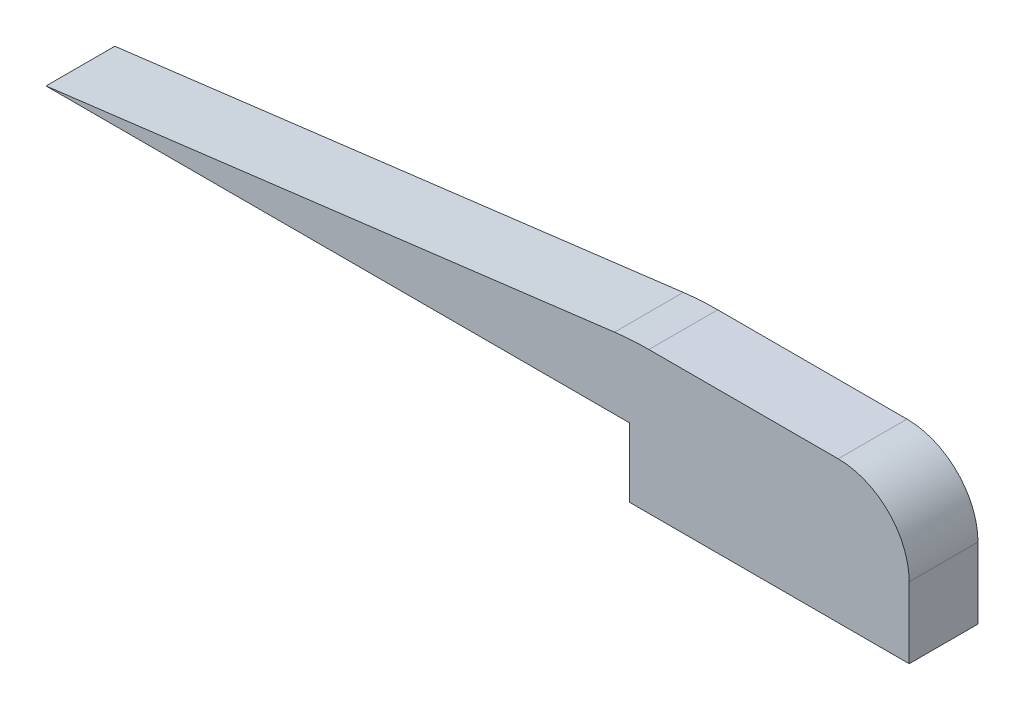
ISO-10303-21;
HEADER;
FILE_DESCRIPTION(('STEP AP214'),'2;1');
FILE_NAME('part.step','',(''),(''),'','','');
FILE_SCHEMA(('AUTOMOTIVE_DESIGN { 1 0 10303 214 1 1 1 1 }'));
ENDSEC;
DATA;
#1=APPLICATION_CONTEXT('core data for automotive mechanical design processes');
#2=APPLICATION_PROTOCOL_DEFINITION('international standard','automotive_design',2000,#1);
#3=PRODUCT_CONTEXT('',#1,'mechanical');
#4=PRODUCT('Part','Part','',(#3));
#5=PRODUCT_RELATED_PRODUCT_CATEGORY('part','',(#4));
#6=PRODUCT_DEFINITION_FORMATION('','',#4);
#7=PRODUCT_DEFINITION_CONTEXT('part definition',#1,'design');
#8=PRODUCT_DEFINITION('design','',#6,#7);
#9=PRODUCT_DEFINITION_SHAPE('','',#8);
#10=(LENGTH_UNIT() NAMED_UNIT(*) SI_UNIT(.MILLI.,.METRE.));
#11=(NAMED_UNIT(*) PLANE_ANGLE_UNIT() SI_UNIT($,.RADIAN.));
#12=(NAMED_UNIT(*) SI_UNIT($,.STERADIAN.) SOLID_ANGLE_UNIT());
#13=UNCERTAINTY_MEASURE_WITH_UNIT(LENGTH_MEASURE(1.E-05),#10,'distance_accuracy_value','');
#14=(GEOMETRIC_REPRESENTATION_CONTEXT(3) GLOBAL_UNCERTAINTY_ASSIGNED_CONTEXT((#13)) GLOBAL_UNIT_ASSIGNED_CONTEXT((#10,
#11,#12)) REPRESENTATION_CONTEXT('',''));
#15=CARTESIAN_POINT('',(0.,0.,0.));
#16=DIRECTION('',(0.,0.,1.));
#17=DIRECTION('',(1.,0.,0.));
#18=AXIS2_PLACEMENT_3D('',#15,#16,#17);
#19=CARTESIAN_POINT('',(34.925,0.,3.175));
#20=DIRECTION('',(0.,0.,-1.));
#21=DIRECTION('',(-1.,0.,0.));
#22=AXIS2_PLACEMENT_3D('',#19,#20,#21);
#23=CYLINDRICAL_SURFACE('',#22,3.2766);
#24=CARTESIAN_POINT('',(34.925,0.,0.));
#25=DIRECTION('',(0.,0.,1.));
#26=DIRECTION('',(-1.,0.,0.));
#27=AXIS2_PLACEMENT_3D('',#24,#25,#26);
#28=CIRCLE('',#27,3.2766);
#29=CARTESIAN_POINT('',(38.2016,0.,0.));
#30=VERTEX_POINT('',#29);
#31=CARTESIAN_POINT('',(34.925,3.2766,0.));
#32=VERTEX_POINT('',#31);
#33=EDGE_CURVE('E191',#30,#32,#28,.T.);
#34=ORIENTED_EDGE('',*,*,#33,.T.);
#35=DIRECTION('',(0.,0.,-1.));
#36=VECTOR('',#35,1.);
#37=CARTESIAN_POINT('',(34.925,3.2766,3.175));
#38=LINE('',#37,#36);
#39=CARTESIAN_POINT('',(34.925,3.2766,3.175));
#40=VERTEX_POINT('',#39);
#41=EDGE_CURVE('E12',#40,#32,#38,.T.);
#42=ORIENTED_EDGE('',*,*,#41,.F.);
#43=CARTESIAN_POINT('',(34.925,0.,3.175));
#44=DIRECTION('',(0.,0.,1.));
#45=DIRECTION('',(-1.,0.,0.));
#46=AXIS2_PLACEMENT_3D('',#43,#44,#45);
#47=CIRCLE('',#46,3.2766);
#48=CARTESIAN_POINT('',(38.2016,0.,3.175));
#49=VERTEX_POINT('',#48);
#50=EDGE_CURVE('E156',#49,#40,#47,.T.);
#51=ORIENTED_EDGE('',*,*,#50,.F.);
#52=DIRECTION('',(0.,0.,-1.));
#53=VECTOR('',#52,1.);
#54=CARTESIAN_POINT('',(38.2016,0.,3.175));
#55=LINE('',#54,#53);
#56=EDGE_CURVE('E131',#49,#30,#55,.T.);
#57=ORIENTED_EDGE('',*,*,#56,.T.);
#58=EDGE_LOOP('',(#34,#42,#51,#57));
#59=FACE_BOUND('',#58,.T.);
#60=ADVANCED_FACE('F36',(#59),#23,.T.);
#61=CARTESIAN_POINT('',(26.1906734033916,3.2766,3.175));
#62=DIRECTION('',(0.,-1.,0.));
#63=DIRECTION('',(1.,0.,0.));
#64=AXIS2_PLACEMENT_3D('',#61,#62,#63);
#65=PLANE('',#64);
#66=DIRECTION('',(-1.,0.,0.));
#67=VECTOR('',#66,1.);
#68=CARTESIAN_POINT('',(26.1906734033916,3.2766,0.));
#69=LINE('',#68,#67);
#70=CARTESIAN_POINT('',(26.1906734033916,3.2766,0.));
#71=VERTEX_POINT('',#70);
#72=EDGE_CURVE('E185',#32,#71,#69,.T.);
#73=ORIENTED_EDGE('',*,*,#72,.T.);
#74=DIRECTION('',(0.,0.,-1.));
#75=VECTOR('',#74,1.);
#76=CARTESIAN_POINT('',(26.1906734033916,3.2766,3.175));
#77=LINE('',#76,#75);
#78=CARTESIAN_POINT('',(26.1906734033916,3.2766,3.175));
#79=VERTEX_POINT('',#78);
#80=EDGE_CURVE('E44',#79,#71,#77,.T.);
#81=ORIENTED_EDGE('',*,*,#80,.F.);
#82=DIRECTION('',(-1.,0.,0.));
#83=VECTOR('',#82,1.);
#84=CARTESIAN_POINT('',(26.1906734033916,3.2766,3.175));
#85=LINE('',#84,#83);
#86=EDGE_CURVE('E95',#40,#79,#85,.T.);
#87=ORIENTED_EDGE('',*,*,#86,.F.);
#88=ORIENTED_EDGE('',*,*,#41,.T.);
#89=EDGE_LOOP('',(#73,#81,#87,#88));
#90=FACE_BOUND('',#89,.T.);
#91=ADVANCED_FACE('F210',(#90),#65,.F.);
#92=CARTESIAN_POINT('',(26.1906734033916,-9.525,3.175));
#93=DIRECTION('',(0.,0.,-1.));
#94=DIRECTION('',(-1.,0.,0.));
#95=AXIS2_PLACEMENT_3D('',#92,#93,#94);
#96=CYLINDRICAL_SURFACE('',#95,12.8016);
#97=CARTESIAN_POINT('',(26.1906734033916,-9.525,0.));
#98=DIRECTION('',(0.,0.,1.));
#99=DIRECTION('',(-1.,0.,0.));
#100=AXIS2_PLACEMENT_3D('',#97,#98,#99);
#101=CIRCLE('',#100,12.8016);
#102=CARTESIAN_POINT('',(24.6028303450744,3.17774446653769,0.));
#103=VERTEX_POINT('',#102);
#104=EDGE_CURVE('E180',#71,#103,#101,.T.);
#105=ORIENTED_EDGE('',*,*,#104,.T.);
#106=DIRECTION('',(0.,0.,-1.));
#107=VECTOR('',#106,1.);
#108=CARTESIAN_POINT('',(24.6028303450744,3.17774446653769,3.175));
#109=LINE('',#108,#107);
#110=CARTESIAN_POINT('',(24.6028303450744,3.17774446653769,3.175));
#111=VERTEX_POINT('',#110);
#112=EDGE_CURVE('E172',#111,#103,#109,.T.);
#113=ORIENTED_EDGE('',*,*,#112,.F.);
#114=CARTESIAN_POINT('',(26.1906734033916,-9.525,3.175));
#115=DIRECTION('',(0.,0.,1.));
#116=DIRECTION('',(-1.,0.,0.));
#117=AXIS2_PLACEMENT_3D('',#114,#115,#116);
#118=CIRCLE('',#117,12.8016);
#119=EDGE_CURVE('E148',#79,#111,#118,.T.);
#120=ORIENTED_EDGE('',*,*,#119,.F.);
#121=ORIENTED_EDGE('',*,*,#80,.T.);
#122=EDGE_LOOP('',(#105,#113,#120,#121));
#123=FACE_BOUND('',#122,.T.);
#124=ADVANCED_FACE('F178',(#123),#96,.T.);
#125=CARTESIAN_POINT('',(-1.63192538722715,-0.101600000000002,3.175));
#126=DIRECTION('',(0.124034734589209,-0.992277876713668,0.));
#127=DIRECTION('',(0.992277876713668,0.124034734589209,0.));
#128=AXIS2_PLACEMENT_3D('',#125,#126,#127);
#129=PLANE('',#128);
#130=DIRECTION('',(-0.992277876713668,-0.124034734589209,0.));
#131=VECTOR('',#130,1.);
#132=CARTESIAN_POINT('',(-1.63192538722715,-0.101600000000002,0.));
#133=LINE('',#132,#131);
#134=CARTESIAN_POINT('',(-1.63192538722715,-0.101600000000002,0.));
#135=VERTEX_POINT('',#134);
#136=EDGE_CURVE('E187',#103,#135,#133,.T.);
#137=ORIENTED_EDGE('',*,*,#136,.T.);
#138=DIRECTION('',(0.,0.,-1.));
#139=VECTOR('',#138,1.);
#140=CARTESIAN_POINT('',(-1.63192538722715,-0.101600000000002,3.175));
#141=LINE('',#140,#139);
#142=CARTESIAN_POINT('',(-1.63192538722715,-0.101600000000002,3.175));
#143=VERTEX_POINT('',#142);
#144=EDGE_CURVE('E169',#143,#135,#141,.T.);
#145=ORIENTED_EDGE('',*,*,#144,.F.);
#146=DIRECTION('',(-0.992277876713668,-0.124034734589209,0.));
#147=VECTOR('',#146,1.);
#148=CARTESIAN_POINT('',(-1.63192538722715,-0.101600000000002,3.175));
#149=LINE('',#148,#147);
#150=EDGE_CURVE('E144',#111,#143,#149,.T.);
#151=ORIENTED_EDGE('',*,*,#150,.F.);
#152=ORIENTED_EDGE('',*,*,#112,.T.);
#153=EDGE_LOOP('',(#137,#145,#151,#152));
#154=FACE_BOUND('',#153,.T.);
#155=ADVANCED_FACE('F217',(#154),#129,.F.);
#156=CARTESIAN_POINT('',(25.2984,-0.101600000000002,3.175));
#157=DIRECTION('',(0.,1.,0.));
#158=DIRECTION('',(-1.,0.,0.));
#159=AXIS2_PLACEMENT_3D('',#156,#157,#158);
#160=PLANE('',#159);
#161=DIRECTION('',(1.,0.,0.));
#162=VECTOR('',#161,1.);
#163=CARTESIAN_POINT('',(25.2984,-0.101600000000002,0.));
#164=LINE('',#163,#162);
#165=CARTESIAN_POINT('',(25.2984,-0.101600000000002,0.));
#166=VERTEX_POINT('',#165);
#167=EDGE_CURVE('E189',#135,#166,#164,.T.);
#168=ORIENTED_EDGE('',*,*,#167,.T.);
#169=DIRECTION('',(0.,0.,-1.));
#170=VECTOR('',#169,1.);
#171=CARTESIAN_POINT('',(25.2984,-0.101600000000002,3.175));
#172=LINE('',#171,#170);
#173=CARTESIAN_POINT('',(25.2984,-0.101600000000002,3.175));
#174=VERTEX_POINT('',#173);
#175=EDGE_CURVE('E124',#174,#166,#172,.T.);
#176=ORIENTED_EDGE('',*,*,#175,.F.);
#177=DIRECTION('',(1.,0.,0.));
#178=VECTOR('',#177,1.);
#179=CARTESIAN_POINT('',(25.2984,-0.101600000000002,3.175));
#180=LINE('',#179,#178);
#181=EDGE_CURVE('E114',#143,#174,#180,.T.);
#182=ORIENTED_EDGE('',*,*,#181,.F.);
#183=ORIENTED_EDGE('',*,*,#144,.T.);
#184=EDGE_LOOP('',(#168,#176,#182,#183));
#185=FACE_BOUND('',#184,.T.);
#186=ADVANCED_FACE('F195',(#185),#160,.F.);
#187=CARTESIAN_POINT('',(25.2984,-3.2766,3.175));
#188=DIRECTION('',(1.,0.,0.));
#189=DIRECTION('',(0.,0.,-1.));
#190=AXIS2_PLACEMENT_3D('',#187,#188,#189);
#191=PLANE('',#190);
#192=DIRECTION('',(0.,-1.,0.));
#193=VECTOR('',#192,1.);
#194=CARTESIAN_POINT('',(25.2984,-3.2766,0.));
#195=LINE('',#194,#193);
#196=CARTESIAN_POINT('',(25.2984,-3.2766,0.));
#197=VERTEX_POINT('',#196);
#198=EDGE_CURVE('E123',#166,#197,#195,.T.);
#199=ORIENTED_EDGE('',*,*,#198,.T.);
#200=DIRECTION('',(0.,0.,-1.));
#201=VECTOR('',#200,1.);
#202=CARTESIAN_POINT('',(25.2984,-3.2766,3.175));
#203=LINE('',#202,#201);
#204=CARTESIAN_POINT('',(25.2984,-3.2766,3.175));
#205=VERTEX_POINT('',#204);
#206=EDGE_CURVE('E120',#205,#197,#203,.T.);
#207=ORIENTED_EDGE('',*,*,#206,.F.);
#208=DIRECTION('',(0.,-1.,0.));
#209=VECTOR('',#208,1.);
#210=CARTESIAN_POINT('',(25.2984,-3.2766,3.175));
#211=LINE('',#210,#209);
#212=EDGE_CURVE('E108',#174,#205,#211,.T.);
#213=ORIENTED_EDGE('',*,*,#212,.F.);
#214=ORIENTED_EDGE('',*,*,#175,.T.);
#215=EDGE_LOOP('',(#199,#207,#213,#214));
#216=FACE_BOUND('',#215,.T.);
#217=ADVANCED_FACE('F121',(#216),#191,.F.);
#218=CARTESIAN_POINT('',(38.2016,-3.2766,3.175));
#219=DIRECTION('',(0.,1.,0.));
#220=DIRECTION('',(0.,0.,1.));
#221=AXIS2_PLACEMENT_3D('',#218,#219,#220);
#222=PLANE('',#221);
#223=DIRECTION('',(1.,0.,0.));
#224=VECTOR('',#223,1.);
#225=CARTESIAN_POINT('',(38.2016,-3.2766,0.));
#226=LINE('',#225,#224);
#227=CARTESIAN_POINT('',(38.2016,-3.2766,0.));
#228=VERTEX_POINT('',#227);
#229=EDGE_CURVE('E81',#197,#228,#226,.T.);
#230=ORIENTED_EDGE('',*,*,#229,.T.);
#231=DIRECTION('',(0.,0.,-1.));
#232=VECTOR('',#231,1.);
#233=CARTESIAN_POINT('',(38.2016,-3.2766,3.175));
#234=LINE('',#233,#232);
#235=CARTESIAN_POINT('',(38.2016,-3.2766,3.175));
#236=VERTEX_POINT('',#235);
#237=EDGE_CURVE('E125',#236,#228,#234,.T.);
#238=ORIENTED_EDGE('',*,*,#237,.F.);
#239=DIRECTION('',(1.,0.,0.));
#240=VECTOR('',#239,1.);
#241=CARTESIAN_POINT('',(38.2016,-3.2766,3.175));
#242=LINE('',#241,#240);
#243=EDGE_CURVE('E112',#205,#236,#242,.T.);
#244=ORIENTED_EDGE('',*,*,#243,.F.);
#245=ORIENTED_EDGE('',*,*,#206,.T.);
#246=EDGE_LOOP('',(#230,#238,#244,#245));
#247=FACE_BOUND('',#246,.T.);
#248=ADVANCED_FACE('F127',(#247),#222,.F.);
#249=CARTESIAN_POINT('',(38.2016,0.,3.175));
#250=DIRECTION('',(-1.,0.,0.));
#251=DIRECTION('',(0.,0.,1.));
#252=AXIS2_PLACEMENT_3D('',#249,#250,#251);
#253=PLANE('',#252);
#254=DIRECTION('',(0.,1.,0.));
#255=VECTOR('',#254,1.);
#256=CARTESIAN_POINT('',(38.2016,0.,0.));
#257=LINE('',#256,#255);
#258=EDGE_CURVE('E87',#228,#30,#257,.T.);
#259=ORIENTED_EDGE('',*,*,#258,.T.);
#260=ORIENTED_EDGE('',*,*,#56,.F.);
#261=DIRECTION('',(0.,1.,0.));
#262=VECTOR('',#261,1.);
#263=CARTESIAN_POINT('',(38.2016,0.,3.175));
#264=LINE('',#263,#262);
#265=EDGE_CURVE('E52',#236,#49,#264,.T.);
#266=ORIENTED_EDGE('',*,*,#265,.F.);
#267=ORIENTED_EDGE('',*,*,#237,.T.);
#268=EDGE_LOOP('',(#259,#260,#266,#267));
#269=FACE_BOUND('',#268,.T.);
#270=ADVANCED_FACE('F199',(#269),#253,.F.);
#271=CARTESIAN_POINT('',(34.925,0.,3.175));
#272=DIRECTION('',(0.,0.,-1.));
#273=DIRECTION('',(-1.,0.,0.));
#274=AXIS2_PLACEMENT_3D('',#271,#272,#273);
#275=PLANE('',#274);
#276=ORIENTED_EDGE('',*,*,#50,.T.);
#277=ORIENTED_EDGE('',*,*,#86,.T.);
#278=ORIENTED_EDGE('',*,*,#119,.T.);
#279=ORIENTED_EDGE('',*,*,#150,.T.);
#280=ORIENTED_EDGE('',*,*,#181,.T.);
#281=ORIENTED_EDGE('',*,*,#212,.T.);
#282=ORIENTED_EDGE('',*,*,#243,.T.);
#283=ORIENTED_EDGE('',*,*,#265,.T.);
#284=EDGE_LOOP('',(#276,#277,#278,#279,#280,#281,#282,#283));
#285=FACE_BOUND('',#284,.T.);
#286=ADVANCED_FACE('F110',(#285),#275,.F.);
#287=CARTESIAN_POINT('',(34.925,0.,0.));
#288=DIRECTION('',(0.,0.,-1.));
#289=DIRECTION('',(-1.,0.,0.));
#290=AXIS2_PLACEMENT_3D('',#287,#288,#289);
#291=PLANE('',#290);
#292=ORIENTED_EDGE('',*,*,#33,.F.);
#293=ORIENTED_EDGE('',*,*,#258,.F.);
#294=ORIENTED_EDGE('',*,*,#229,.F.);
#295=ORIENTED_EDGE('',*,*,#198,.F.);
#296=ORIENTED_EDGE('',*,*,#167,.F.);
#297=ORIENTED_EDGE('',*,*,#136,.F.);
#298=ORIENTED_EDGE('',*,*,#104,.F.);
#299=ORIENTED_EDGE('',*,*,#72,.F.);
#300=EDGE_LOOP('',(#292,#293,#294,#295,#296,#297,#298,#299));
#301=FACE_BOUND('',#300,.T.);
#302=ADVANCED_FACE('F184',(#301),#291,.T.);
#303=CLOSED_SHELL('',(#60,#91,#124,#155,#186,#217,#248,#270,#286,#302));
#304=MANIFOLD_SOLID_BREP('B2',#303);
#305=ADVANCED_BREP_SHAPE_REPRESENTATION('',(#18,#304),#14);
#306=SHAPE_DEFINITION_REPRESENTATION(#9,#305);
ENDSEC;
END-ISO-10303-21;
